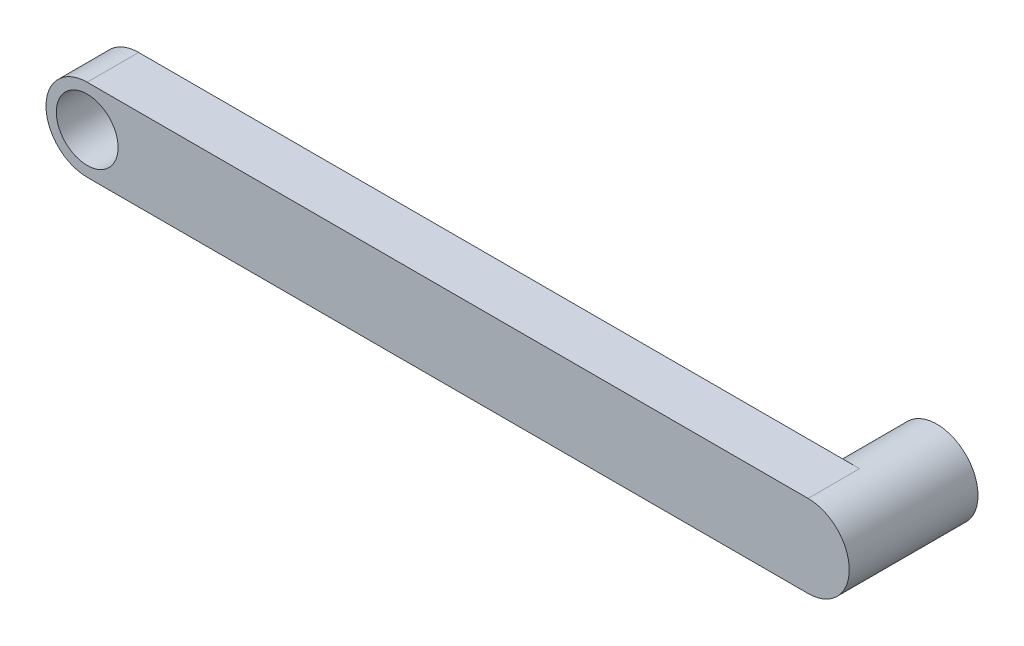
ISO-10303-21;
HEADER;
FILE_DESCRIPTION(('STEP AP214'),'2;1');
FILE_NAME('part.step','',(''),(''),'','','');
FILE_SCHEMA(('AUTOMOTIVE_DESIGN { 1 0 10303 214 1 1 1 1 }'));
ENDSEC;
DATA;
#1=APPLICATION_CONTEXT('core data for automotive mechanical design processes');
#2=APPLICATION_PROTOCOL_DEFINITION('international standard','automotive_design',2000,#1);
#3=PRODUCT_CONTEXT('',#1,'mechanical');
#4=PRODUCT('Part','Part','',(#3));
#5=PRODUCT_RELATED_PRODUCT_CATEGORY('part','',(#4));
#6=PRODUCT_DEFINITION_FORMATION('','',#4);
#7=PRODUCT_DEFINITION_CONTEXT('part definition',#1,'design');
#8=PRODUCT_DEFINITION('design','',#6,#7);
#9=PRODUCT_DEFINITION_SHAPE('','',#8);
#10=(LENGTH_UNIT() NAMED_UNIT(*) SI_UNIT(.MILLI.,.METRE.));
#11=(NAMED_UNIT(*) PLANE_ANGLE_UNIT() SI_UNIT($,.RADIAN.));
#12=(NAMED_UNIT(*) SI_UNIT($,.STERADIAN.) SOLID_ANGLE_UNIT());
#13=UNCERTAINTY_MEASURE_WITH_UNIT(LENGTH_MEASURE(1.E-05),#10,'distance_accuracy_value','');
#14=(GEOMETRIC_REPRESENTATION_CONTEXT(3) GLOBAL_UNCERTAINTY_ASSIGNED_CONTEXT((#13)) GLOBAL_UNIT_ASSIGNED_CONTEXT((#10,
#11,#12)) REPRESENTATION_CONTEXT('',''));
#15=CARTESIAN_POINT('',(0.,0.,0.));
#16=DIRECTION('',(0.,0.,1.));
#17=DIRECTION('',(1.,0.,0.));
#18=AXIS2_PLACEMENT_3D('',#15,#16,#17);
#19=CARTESIAN_POINT('',(0.,-8.,10.));
#20=DIRECTION('',(0.,1.,0.));
#21=DIRECTION('',(-1.,0.,0.));
#22=AXIS2_PLACEMENT_3D('',#19,#20,#21);
#23=PLANE('',#22);
#24=DIRECTION('',(1.,0.,0.));
#25=VECTOR('',#24,1.);
#26=CARTESIAN_POINT('',(0.,-8.,0.));
#27=LINE('',#26,#25);
#28=CARTESIAN_POINT('',(50.,-8.,0.));
#29=VERTEX_POINT('',#28);
#30=CARTESIAN_POINT('',(190.,-8.00000000000001,0.));
#31=VERTEX_POINT('',#30);
#32=EDGE_CURVE('E91',#29,#31,#27,.T.);
#33=ORIENTED_EDGE('',*,*,#32,.T.);
#34=DIRECTION('',(0.,0.,-1.));
#35=VECTOR('',#34,1.);
#36=CARTESIAN_POINT('',(190.,-8.00000000000001,10.));
#37=LINE('',#36,#35);
#38=CARTESIAN_POINT('',(190.,-8.00000000000001,10.));
#39=VERTEX_POINT('',#38);
#40=EDGE_CURVE('E11',#39,#31,#37,.T.);
#41=ORIENTED_EDGE('',*,*,#40,.F.);
#42=DIRECTION('',(1.,0.,0.));
#43=VECTOR('',#42,1.);
#44=CARTESIAN_POINT('',(0.,-8.,10.));
#45=LINE('',#44,#43);
#46=CARTESIAN_POINT('',(50.,-8.,10.));
#47=VERTEX_POINT('',#46);
#48=EDGE_CURVE('E118',#47,#39,#45,.T.);
#49=ORIENTED_EDGE('',*,*,#48,.F.);
#50=DIRECTION('',(0.,0.,-1.));
#51=VECTOR('',#50,1.);
#52=CARTESIAN_POINT('',(50.,-8.,10.));
#53=LINE('',#52,#51);
#54=EDGE_CURVE('E102',#47,#29,#53,.T.);
#55=ORIENTED_EDGE('',*,*,#54,.T.);
#56=EDGE_LOOP('',(#33,#41,#49,#55));
#57=FACE_BOUND('',#56,.T.);
#58=ADVANCED_FACE('F39',(#57),#23,.F.);
#59=CARTESIAN_POINT('',(190.,0.,10.));
#60=DIRECTION('',(0.,0.,-1.));
#61=DIRECTION('',(-1.,0.,0.));
#62=AXIS2_PLACEMENT_3D('',#59,#60,#61);
#63=CYLINDRICAL_SURFACE('',#62,8.00000000000001);
#64=ORIENTED_EDGE('',*,*,#40,.T.);
#65=CARTESIAN_POINT('',(190.,0.,0.));
#66=DIRECTION('',(0.,0.,1.));
#67=DIRECTION('',(1.,0.,0.));
#68=AXIS2_PLACEMENT_3D('',#65,#66,#67);
#69=CIRCLE('',#68,8.00000000000001);
#70=CARTESIAN_POINT('',(190.,8.00000000000001,0.));
#71=VERTEX_POINT('',#70);
#72=EDGE_CURVE('E87',#71,#31,#69,.T.);
#73=ORIENTED_EDGE('',*,*,#72,.F.);
#74=DIRECTION('',(0.,0.,-1.));
#75=VECTOR('',#74,1.);
#76=CARTESIAN_POINT('',(190.,8.00000000000001,10.));
#77=LINE('',#76,#75);
#78=CARTESIAN_POINT('',(190.,8.00000000000001,10.));
#79=VERTEX_POINT('',#78);
#80=EDGE_CURVE('E48',#79,#71,#77,.T.);
#81=ORIENTED_EDGE('',*,*,#80,.F.);
#82=CARTESIAN_POINT('',(190.,0.,10.));
#83=DIRECTION('',(0.,0.,1.));
#84=DIRECTION('',(1.,0.,0.));
#85=AXIS2_PLACEMENT_3D('',#82,#83,#84);
#86=CIRCLE('',#85,8.00000000000001);
#87=EDGE_CURVE('E81',#39,#79,#86,.T.);
#88=ORIENTED_EDGE('',*,*,#87,.F.);
#89=EDGE_LOOP('',(#64,#73,#81,#88));
#90=FACE_BOUND('',#89,.T.);
#91=CARTESIAN_POINT('',(190.,0.,-15.));
#92=DIRECTION('',(0.,0.,1.));
#93=DIRECTION('',(1.,0.,0.));
#94=AXIS2_PLACEMENT_3D('',#91,#92,#93);
#95=CIRCLE('',#94,8.00000000000001);
#96=CARTESIAN_POINT('',(198.,0.,-15.));
#97=VERTEX_POINT('',#96);
#98=EDGE_CURVE('E95',#97,#97,#95,.T.);
#99=ORIENTED_EDGE('',*,*,#98,.T.);
#100=EDGE_LOOP('',(#99));
#101=FACE_BOUND('',#100,.T.);
#102=ADVANCED_FACE('F98',(#90,#101),#63,.T.);
#103=CARTESIAN_POINT('',(0.,8.,10.));
#104=DIRECTION('',(0.,1.,0.));
#105=DIRECTION('',(-1.,0.,0.));
#106=AXIS2_PLACEMENT_3D('',#103,#104,#105);
#107=PLANE('',#106);
#108=DIRECTION('',(1.,0.,0.));
#109=VECTOR('',#108,1.);
#110=CARTESIAN_POINT('',(0.,8.,0.));
#111=LINE('',#110,#109);
#112=CARTESIAN_POINT('',(50.,8.,0.));
#113=VERTEX_POINT('',#112);
#114=EDGE_CURVE('E93',#113,#71,#111,.T.);
#115=ORIENTED_EDGE('',*,*,#114,.F.);
#116=DIRECTION('',(0.,0.,-1.));
#117=VECTOR('',#116,1.);
#118=CARTESIAN_POINT('',(50.,8.,10.));
#119=LINE('',#118,#117);
#120=CARTESIAN_POINT('',(50.,8.,10.));
#121=VERTEX_POINT('',#120);
#122=EDGE_CURVE('E71',#121,#113,#119,.T.);
#123=ORIENTED_EDGE('',*,*,#122,.F.);
#124=DIRECTION('',(1.,0.,0.));
#125=VECTOR('',#124,1.);
#126=CARTESIAN_POINT('',(0.,8.,10.));
#127=LINE('',#126,#125);
#128=EDGE_CURVE('E122',#121,#79,#127,.T.);
#129=ORIENTED_EDGE('',*,*,#128,.T.);
#130=ORIENTED_EDGE('',*,*,#80,.T.);
#131=EDGE_LOOP('',(#115,#123,#129,#130));
#132=FACE_BOUND('',#131,.T.);
#133=ADVANCED_FACE('F144',(#132),#107,.T.);
#134=CARTESIAN_POINT('',(50.,0.,10.));
#135=DIRECTION('',(0.,0.,-1.));
#136=DIRECTION('',(-1.,0.,0.));
#137=AXIS2_PLACEMENT_3D('',#134,#135,#136);
#138=CYLINDRICAL_SURFACE('',#137,8.00000000000001);
#139=CARTESIAN_POINT('',(50.,0.,0.));
#140=DIRECTION('',(0.,0.,1.));
#141=DIRECTION('',(1.,0.,0.));
#142=AXIS2_PLACEMENT_3D('',#139,#140,#141);
#143=CIRCLE('',#142,8.00000000000001);
#144=EDGE_CURVE('E74',#113,#29,#143,.T.);
#145=ORIENTED_EDGE('',*,*,#144,.T.);
#146=ORIENTED_EDGE('',*,*,#54,.F.);
#147=CARTESIAN_POINT('',(50.,0.,10.));
#148=DIRECTION('',(0.,0.,1.));
#149=DIRECTION('',(1.,0.,0.));
#150=AXIS2_PLACEMENT_3D('',#147,#148,#149);
#151=CIRCLE('',#150,8.00000000000001);
#152=EDGE_CURVE('E57',#121,#47,#151,.T.);
#153=ORIENTED_EDGE('',*,*,#152,.F.);
#154=ORIENTED_EDGE('',*,*,#122,.T.);
#155=EDGE_LOOP('',(#145,#146,#153,#154));
#156=FACE_BOUND('',#155,.T.);
#157=ADVANCED_FACE('F136',(#156),#138,.T.);
#158=CARTESIAN_POINT('',(50.,0.,10.));
#159=DIRECTION('',(0.,0.,-1.));
#160=DIRECTION('',(-1.,0.,0.));
#161=AXIS2_PLACEMENT_3D('',#158,#159,#160);
#162=CYLINDRICAL_SURFACE('',#161,6.);
#163=CARTESIAN_POINT('',(50.,0.,10.));
#164=DIRECTION('',(0.,0.,1.));
#165=DIRECTION('',(1.,0.,0.));
#166=AXIS2_PLACEMENT_3D('',#163,#164,#165);
#167=CIRCLE('',#166,6.);
#168=CARTESIAN_POINT('',(56.,0.,10.));
#169=VERTEX_POINT('',#168);
#170=EDGE_CURVE('E126',#169,#169,#167,.T.);
#171=ORIENTED_EDGE('',*,*,#170,.T.);
#172=EDGE_LOOP('',(#171));
#173=FACE_BOUND('',#172,.T.);
#174=CARTESIAN_POINT('',(50.,0.,0.));
#175=DIRECTION('',(0.,0.,1.));
#176=DIRECTION('',(1.,0.,0.));
#177=AXIS2_PLACEMENT_3D('',#174,#175,#176);
#178=CIRCLE('',#177,6.);
#179=CARTESIAN_POINT('',(56.,0.,0.));
#180=VERTEX_POINT('',#179);
#181=EDGE_CURVE('E120',#180,#180,#178,.T.);
#182=ORIENTED_EDGE('',*,*,#181,.F.);
#183=EDGE_LOOP('',(#182));
#184=FACE_BOUND('',#183,.T.);
#185=ADVANCED_FACE('F133',(#173,#184),#162,.F.);
#186=CARTESIAN_POINT('',(0.,0.,10.));
#187=DIRECTION('',(0.,0.,1.));
#188=DIRECTION('',(1.,0.,0.));
#189=AXIS2_PLACEMENT_3D('',#186,#187,#188);
#190=PLANE('',#189);
#191=ORIENTED_EDGE('',*,*,#48,.T.);
#192=ORIENTED_EDGE('',*,*,#87,.T.);
#193=ORIENTED_EDGE('',*,*,#128,.F.);
#194=ORIENTED_EDGE('',*,*,#152,.T.);
#195=EDGE_LOOP('',(#191,#192,#193,#194));
#196=FACE_BOUND('',#195,.T.);
#197=ORIENTED_EDGE('',*,*,#170,.F.);
#198=EDGE_LOOP('',(#197));
#199=FACE_BOUND('',#198,.T.);
#200=ADVANCED_FACE('F135',(#196,#199),#190,.T.);
#201=CARTESIAN_POINT('',(0.,0.,0.));
#202=DIRECTION('',(0.,0.,1.));
#203=DIRECTION('',(1.,0.,0.));
#204=AXIS2_PLACEMENT_3D('',#201,#202,#203);
#205=PLANE('',#204);
#206=ORIENTED_EDGE('',*,*,#114,.T.);
#207=ORIENTED_EDGE('',*,*,#72,.T.);
#208=ORIENTED_EDGE('',*,*,#32,.F.);
#209=ORIENTED_EDGE('',*,*,#144,.F.);
#210=EDGE_LOOP('',(#206,#207,#208,#209));
#211=FACE_BOUND('',#210,.T.);
#212=ORIENTED_EDGE('',*,*,#181,.T.);
#213=EDGE_LOOP('',(#212));
#214=FACE_BOUND('',#213,.T.);
#215=ADVANCED_FACE('F88',(#211,#214),#205,.F.);
#216=CARTESIAN_POINT('',(0.,0.,-15.));
#217=DIRECTION('',(0.,0.,1.));
#218=DIRECTION('',(1.,0.,0.));
#219=AXIS2_PLACEMENT_3D('',#216,#217,#218);
#220=PLANE('',#219);
#221=ORIENTED_EDGE('',*,*,#98,.F.);
#222=EDGE_LOOP('',(#221));
#223=FACE_BOUND('',#222,.T.);
#224=ADVANCED_FACE('F168',(#223),#220,.F.);
#225=CLOSED_SHELL('',(#58,#102,#133,#157,#185,#200,#215,#224));
#226=MANIFOLD_SOLID_BREP('B2',#225);
#227=ADVANCED_BREP_SHAPE_REPRESENTATION('',(#18,#226),#14);
#228=SHAPE_DEFINITION_REPRESENTATION(#9,#227);
ENDSEC;
END-ISO-10303-21;
